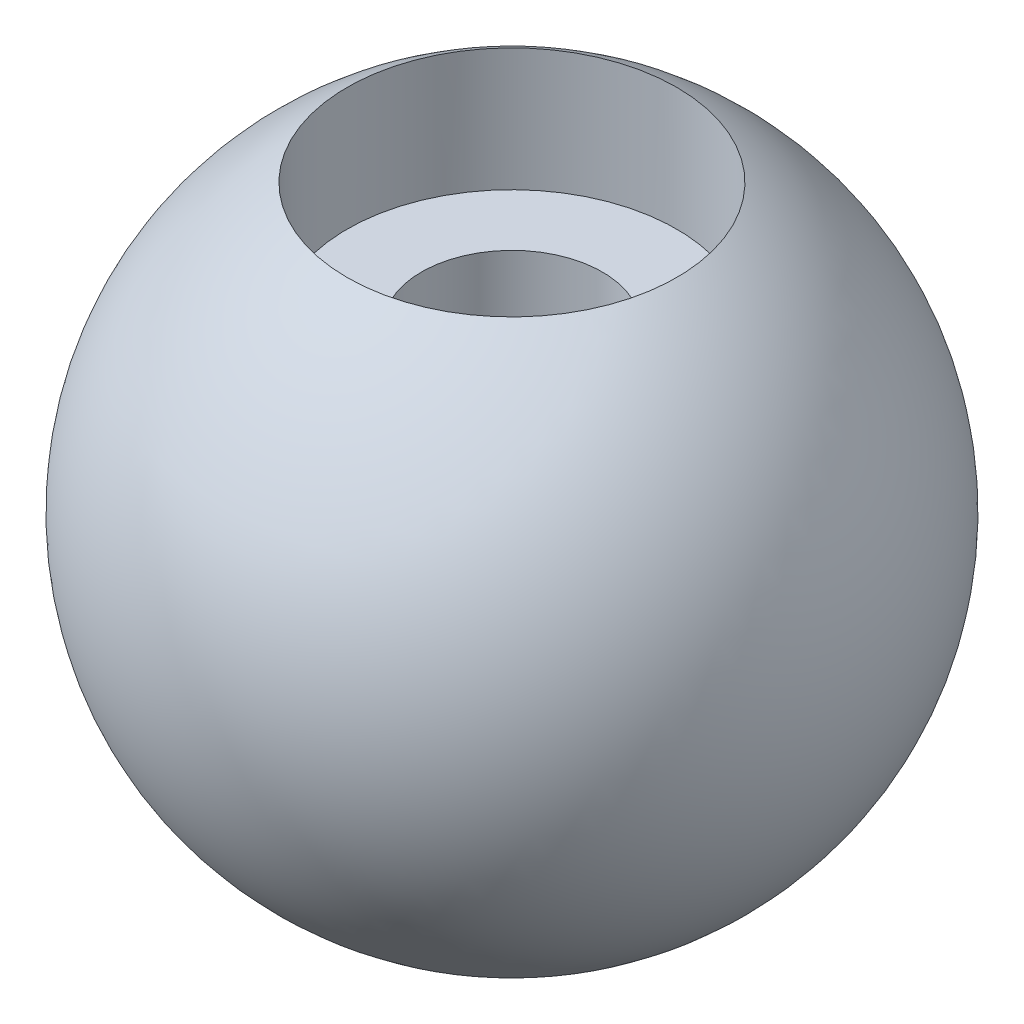
ISO-10303-21;
HEADER;
FILE_DESCRIPTION(('STEP AP214'),'2;1');
FILE_NAME('part.step','',(''),(''),'','','');
FILE_SCHEMA(('AUTOMOTIVE_DESIGN { 1 0 10303 214 1 1 1 1 }'));
ENDSEC;
DATA;
#1=APPLICATION_CONTEXT('core data for automotive mechanical design processes');
#2=APPLICATION_PROTOCOL_DEFINITION('international standard','automotive_design',2000,#1);
#3=PRODUCT_CONTEXT('',#1,'mechanical');
#4=PRODUCT('Part','Part','',(#3));
#5=PRODUCT_RELATED_PRODUCT_CATEGORY('part','',(#4));
#6=PRODUCT_DEFINITION_FORMATION('','',#4);
#7=PRODUCT_DEFINITION_CONTEXT('part definition',#1,'design');
#8=PRODUCT_DEFINITION('design','',#6,#7);
#9=PRODUCT_DEFINITION_SHAPE('','',#8);
#10=(LENGTH_UNIT() NAMED_UNIT(*) SI_UNIT(.MILLI.,.METRE.));
#11=(NAMED_UNIT(*) PLANE_ANGLE_UNIT() SI_UNIT($,.RADIAN.));
#12=(NAMED_UNIT(*) SI_UNIT($,.STERADIAN.) SOLID_ANGLE_UNIT());
#13=UNCERTAINTY_MEASURE_WITH_UNIT(LENGTH_MEASURE(1.E-05),#10,'distance_accuracy_value','');
#14=(GEOMETRIC_REPRESENTATION_CONTEXT(3) GLOBAL_UNCERTAINTY_ASSIGNED_CONTEXT((#13)) GLOBAL_UNIT_ASSIGNED_CONTEXT((#10,
#11,#12)) REPRESENTATION_CONTEXT('',''));
#15=CARTESIAN_POINT('',(0.,0.,0.));
#16=DIRECTION('',(0.,0.,1.));
#17=DIRECTION('',(1.,0.,0.));
#18=AXIS2_PLACEMENT_3D('',#15,#16,#17);
#19=CARTESIAN_POINT('',(0.,0.,0.));
#20=DIRECTION('',(0.,1.,0.));
#21=DIRECTION('',(1.,0.,0.));
#22=AXIS2_PLACEMENT_3D('',#19,#20,#21);
#23=SPHERICAL_SURFACE('',#22,9.525);
#24=CARTESIAN_POINT('',(0.,8.24889197104678,0.));
#25=DIRECTION('',(0.,-1.,0.));
#26=DIRECTION('',(0.,0.,-1.));
#27=AXIS2_PLACEMENT_3D('',#24,#25,#26);
#28=CIRCLE('',#27,4.7625);
#29=CARTESIAN_POINT('',(0.,8.24889197104678,-4.7625));
#30=VERTEX_POINT('',#29);
#31=EDGE_CURVE('E37',#30,#30,#28,.F.);
#32=ORIENTED_EDGE('',*,*,#31,.F.);
#33=EDGE_LOOP('',(#32));
#34=FACE_BOUND('',#33,.T.);
#35=CARTESIAN_POINT('',(0.,-9.15866379773818,0.));
#36=DIRECTION('',(0.,1.,0.));
#37=DIRECTION('',(0.,0.,1.));
#38=AXIS2_PLACEMENT_3D('',#35,#36,#37);
#39=CIRCLE('',#38,2.6162);
#40=CARTESIAN_POINT('',(0.,-9.15866379773818,2.6162));
#41=VERTEX_POINT('',#40);
#42=EDGE_CURVE('E10',#41,#41,#39,.F.);
#43=ORIENTED_EDGE('',*,*,#42,.F.);
#44=EDGE_LOOP('',(#43));
#45=FACE_BOUND('',#44,.T.);
#46=ADVANCED_FACE('F31',(#34,#45),#23,.T.);
#47=CARTESIAN_POINT('',(0.,7.81837307122567,0.));
#48=DIRECTION('',(0.,1.,0.));
#49=DIRECTION('',(0.,0.,1.));
#50=AXIS2_PLACEMENT_3D('',#47,#48,#49);
#51=CYLINDRICAL_SURFACE('',#50,2.6162);
#52=CARTESIAN_POINT('',(0.,4.699,0.));
#53=DIRECTION('',(0.,1.,0.));
#54=DIRECTION('',(0.,0.,1.));
#55=AXIS2_PLACEMENT_3D('',#52,#53,#54);
#56=CIRCLE('',#55,2.6162);
#57=CARTESIAN_POINT('',(0.,4.699,2.6162));
#58=VERTEX_POINT('',#57);
#59=EDGE_CURVE('E41',#58,#58,#56,.T.);
#60=ORIENTED_EDGE('',*,*,#59,.T.);
#61=EDGE_LOOP('',(#60));
#62=FACE_BOUND('',#61,.T.);
#63=ORIENTED_EDGE('',*,*,#42,.T.);
#64=EDGE_LOOP('',(#63));
#65=FACE_BOUND('',#64,.T.);
#66=ADVANCED_FACE('F56',(#62,#65),#51,.F.);
#67=CARTESIAN_POINT('',(0.,7.81837307122567,0.));
#68=DIRECTION('',(0.,1.,0.));
#69=DIRECTION('',(0.,0.,1.));
#70=AXIS2_PLACEMENT_3D('',#67,#68,#69);
#71=CYLINDRICAL_SURFACE('',#70,4.7625);
#72=CARTESIAN_POINT('',(0.,4.699,0.));
#73=DIRECTION('',(0.,1.,0.));
#74=DIRECTION('',(0.,0.,1.));
#75=AXIS2_PLACEMENT_3D('',#72,#73,#74);
#76=CIRCLE('',#75,4.7625);
#77=CARTESIAN_POINT('',(0.,4.699,4.7625));
#78=VERTEX_POINT('',#77);
#79=EDGE_CURVE('E45',#78,#78,#76,.T.);
#80=ORIENTED_EDGE('',*,*,#79,.F.);
#81=EDGE_LOOP('',(#80));
#82=FACE_BOUND('',#81,.T.);
#83=ORIENTED_EDGE('',*,*,#31,.T.);
#84=EDGE_LOOP('',(#83));
#85=FACE_BOUND('',#84,.T.);
#86=ADVANCED_FACE('F54',(#82,#85),#71,.F.);
#87=CARTESIAN_POINT('',(4.7625,4.699,0.));
#88=DIRECTION('',(0.,1.,0.));
#89=DIRECTION('',(0.,0.,1.));
#90=AXIS2_PLACEMENT_3D('',#87,#88,#89);
#91=PLANE('',#90);
#92=ORIENTED_EDGE('',*,*,#79,.T.);
#93=EDGE_LOOP('',(#92));
#94=FACE_BOUND('',#93,.T.);
#95=ORIENTED_EDGE('',*,*,#59,.F.);
#96=EDGE_LOOP('',(#95));
#97=FACE_BOUND('',#96,.T.);
#98=ADVANCED_FACE('F51',(#94,#97),#91,.T.);
#99=CLOSED_SHELL('',(#46,#66,#86,#98));
#100=MANIFOLD_SOLID_BREP('B2',#99);
#101=ADVANCED_BREP_SHAPE_REPRESENTATION('',(#18,#100),#14);
#102=SHAPE_DEFINITION_REPRESENTATION(#9,#101);
ENDSEC;
END-ISO-10303-21;
